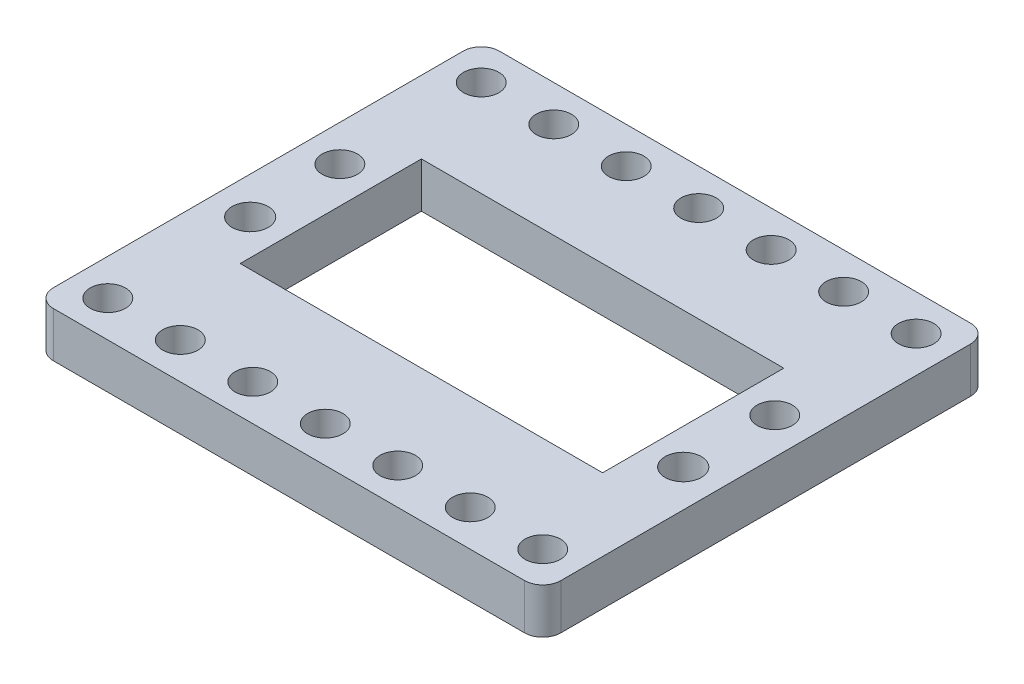
ISO-10303-21;
HEADER;
FILE_DESCRIPTION(('STEP AP214'),'2;1');
FILE_NAME('part.step','',(''),(''),'','','');
FILE_SCHEMA(('AUTOMOTIVE_DESIGN { 1 0 10303 214 1 1 1 1 }'));
ENDSEC;
DATA;
#1=APPLICATION_CONTEXT('core data for automotive mechanical design processes');
#2=APPLICATION_PROTOCOL_DEFINITION('international standard','automotive_design',2000,#1);
#3=PRODUCT_CONTEXT('',#1,'mechanical');
#4=PRODUCT('Part','Part','',(#3));
#5=PRODUCT_RELATED_PRODUCT_CATEGORY('part','',(#4));
#6=PRODUCT_DEFINITION_FORMATION('','',#4);
#7=PRODUCT_DEFINITION_CONTEXT('part definition',#1,'design');
#8=PRODUCT_DEFINITION('design','',#6,#7);
#9=PRODUCT_DEFINITION_SHAPE('','',#8);
#10=(LENGTH_UNIT() NAMED_UNIT(*) SI_UNIT(.MILLI.,.METRE.));
#11=(NAMED_UNIT(*) PLANE_ANGLE_UNIT() SI_UNIT($,.RADIAN.));
#12=(NAMED_UNIT(*) SI_UNIT($,.STERADIAN.) SOLID_ANGLE_UNIT());
#13=UNCERTAINTY_MEASURE_WITH_UNIT(LENGTH_MEASURE(1.E-05),#10,'distance_accuracy_value','');
#14=(GEOMETRIC_REPRESENTATION_CONTEXT(3) GLOBAL_UNCERTAINTY_ASSIGNED_CONTEXT((#13)) GLOBAL_UNIT_ASSIGNED_CONTEXT((#10,
#11,#12)) REPRESENTATION_CONTEXT('',''));
#15=CARTESIAN_POINT('',(0.,0.,0.));
#16=DIRECTION('',(0.,0.,1.));
#17=DIRECTION('',(1.,0.,0.));
#18=AXIS2_PLACEMENT_3D('',#15,#16,#17);
#19=CARTESIAN_POINT('',(76.,5.,2.));
#20=DIRECTION('',(0.,-1.,0.));
#21=DIRECTION('',(0.,0.,-1.));
#22=AXIS2_PLACEMENT_3D('',#19,#20,#21);
#23=CYLINDRICAL_SURFACE('',#22,2.);
#24=DIRECTION('',(0.,-1.,0.));
#25=VECTOR('',#24,1.);
#26=CARTESIAN_POINT('',(76.,5.,0.));
#27=LINE('',#26,#25);
#28=CARTESIAN_POINT('',(76.,5.,0.));
#29=VERTEX_POINT('',#28);
#30=CARTESIAN_POINT('',(76.,0.,0.));
#31=VERTEX_POINT('',#30);
#32=EDGE_CURVE('E304',#29,#31,#27,.T.);
#33=ORIENTED_EDGE('',*,*,#32,.F.);
#34=CARTESIAN_POINT('',(76.,5.,2.));
#35=DIRECTION('',(0.,1.,0.));
#36=DIRECTION('',(0.,0.,1.));
#37=AXIS2_PLACEMENT_3D('',#34,#35,#36);
#38=CIRCLE('',#37,2.);
#39=CARTESIAN_POINT('',(78.,5.,2.));
#40=VERTEX_POINT('',#39);
#41=EDGE_CURVE('E45',#40,#29,#38,.T.);
#42=ORIENTED_EDGE('',*,*,#41,.F.);
#43=DIRECTION('',(0.,-1.,0.));
#44=VECTOR('',#43,1.);
#45=CARTESIAN_POINT('',(78.,-5.,2.));
#46=LINE('',#45,#44);
#47=CARTESIAN_POINT('',(78.,0.,2.));
#48=VERTEX_POINT('',#47);
#49=EDGE_CURVE('E307',#48,#40,#46,.F.);
#50=ORIENTED_EDGE('',*,*,#49,.F.);
#51=CARTESIAN_POINT('',(76.,0.,2.));
#52=DIRECTION('',(0.,1.,0.));
#53=DIRECTION('',(0.,0.,1.));
#54=AXIS2_PLACEMENT_3D('',#51,#52,#53);
#55=CIRCLE('',#54,2.);
#56=EDGE_CURVE('E12',#31,#48,#55,.F.);
#57=ORIENTED_EDGE('',*,*,#56,.F.);
#58=EDGE_LOOP('',(#33,#42,#50,#57));
#59=FACE_BOUND('',#58,.T.);
#60=ADVANCED_FACE('F38',(#59),#23,.T.);
#61=CARTESIAN_POINT('',(76.,-5.,47.22));
#62=DIRECTION('',(0.,-1.,0.));
#63=DIRECTION('',(0.,0.,-1.));
#64=AXIS2_PLACEMENT_3D('',#61,#62,#63);
#65=CYLINDRICAL_SURFACE('',#64,2.);
#66=DIRECTION('',(0.,-1.,0.));
#67=VECTOR('',#66,1.);
#68=CARTESIAN_POINT('',(78.,-5.,47.22));
#69=LINE('',#68,#67);
#70=CARTESIAN_POINT('',(78.,5.,47.22));
#71=VERTEX_POINT('',#70);
#72=CARTESIAN_POINT('',(78.,0.,47.22));
#73=VERTEX_POINT('',#72);
#74=EDGE_CURVE('E292',#71,#73,#69,.T.);
#75=ORIENTED_EDGE('',*,*,#74,.F.);
#76=CARTESIAN_POINT('',(76.,5.,47.22));
#77=DIRECTION('',(0.,1.,0.));
#78=DIRECTION('',(0.,0.,1.));
#79=AXIS2_PLACEMENT_3D('',#76,#77,#78);
#80=CIRCLE('',#79,2.);
#81=CARTESIAN_POINT('',(76.,5.,49.22));
#82=VERTEX_POINT('',#81);
#83=EDGE_CURVE('E296',#82,#71,#80,.T.);
#84=ORIENTED_EDGE('',*,*,#83,.F.);
#85=DIRECTION('',(0.,-1.,0.));
#86=VECTOR('',#85,1.);
#87=CARTESIAN_POINT('',(76.,5.,49.22));
#88=LINE('',#87,#86);
#89=CARTESIAN_POINT('',(76.,0.,49.22));
#90=VERTEX_POINT('',#89);
#91=EDGE_CURVE('E302',#90,#82,#88,.F.);
#92=ORIENTED_EDGE('',*,*,#91,.F.);
#93=CARTESIAN_POINT('',(76.,0.,47.22));
#94=DIRECTION('',(0.,1.,0.));
#95=DIRECTION('',(0.,0.,1.));
#96=AXIS2_PLACEMENT_3D('',#93,#94,#95);
#97=CIRCLE('',#96,2.);
#98=EDGE_CURVE('E301',#73,#90,#97,.F.);
#99=ORIENTED_EDGE('',*,*,#98,.F.);
#100=EDGE_LOOP('',(#75,#84,#92,#99));
#101=FACE_BOUND('',#100,.T.);
#102=ADVANCED_FACE('F401',(#101),#65,.T.);
#103=CARTESIAN_POINT('',(24.,-5.,47.22));
#104=DIRECTION('',(0.,1.,0.));
#105=DIRECTION('',(0.,0.,1.));
#106=AXIS2_PLACEMENT_3D('',#103,#104,#105);
#107=CYLINDRICAL_SURFACE('',#106,2.);
#108=DIRECTION('',(0.,1.,0.));
#109=VECTOR('',#108,1.);
#110=CARTESIAN_POINT('',(22.,-5.,47.22));
#111=LINE('',#110,#109);
#112=CARTESIAN_POINT('',(22.,0.,47.22));
#113=VERTEX_POINT('',#112);
#114=CARTESIAN_POINT('',(22.,5.,47.22));
#115=VERTEX_POINT('',#114);
#116=EDGE_CURVE('E280',#113,#115,#111,.T.);
#117=ORIENTED_EDGE('',*,*,#116,.F.);
#118=CARTESIAN_POINT('',(24.,0.,47.22));
#119=DIRECTION('',(0.,1.,0.));
#120=DIRECTION('',(0.,0.,1.));
#121=AXIS2_PLACEMENT_3D('',#118,#119,#120);
#122=CIRCLE('',#121,2.);
#123=CARTESIAN_POINT('',(24.,0.,49.22));
#124=VERTEX_POINT('',#123);
#125=EDGE_CURVE('E286',#124,#113,#122,.F.);
#126=ORIENTED_EDGE('',*,*,#125,.F.);
#127=DIRECTION('',(0.,1.,0.));
#128=VECTOR('',#127,1.);
#129=CARTESIAN_POINT('',(24.,5.,49.22));
#130=LINE('',#129,#128);
#131=CARTESIAN_POINT('',(24.,5.,49.22));
#132=VERTEX_POINT('',#131);
#133=EDGE_CURVE('E283',#132,#124,#130,.F.);
#134=ORIENTED_EDGE('',*,*,#133,.F.);
#135=CARTESIAN_POINT('',(24.,5.,47.22));
#136=DIRECTION('',(0.,1.,0.));
#137=DIRECTION('',(0.,0.,1.));
#138=AXIS2_PLACEMENT_3D('',#135,#136,#137);
#139=CIRCLE('',#138,2.);
#140=EDGE_CURVE('E288',#115,#132,#139,.T.);
#141=ORIENTED_EDGE('',*,*,#140,.F.);
#142=EDGE_LOOP('',(#117,#126,#134,#141));
#143=FACE_BOUND('',#142,.T.);
#144=ADVANCED_FACE('F405',(#143),#107,.T.);
#145=CARTESIAN_POINT('',(24.,-5.,2.));
#146=DIRECTION('',(0.,-1.,0.));
#147=DIRECTION('',(0.,0.,-1.));
#148=AXIS2_PLACEMENT_3D('',#145,#146,#147);
#149=CYLINDRICAL_SURFACE('',#148,2.);
#150=DIRECTION('',(0.,-1.,0.));
#151=VECTOR('',#150,1.);
#152=CARTESIAN_POINT('',(22.,-5.,2.));
#153=LINE('',#152,#151);
#154=CARTESIAN_POINT('',(22.,5.,2.));
#155=VERTEX_POINT('',#154);
#156=CARTESIAN_POINT('',(22.,0.,2.));
#157=VERTEX_POINT('',#156);
#158=EDGE_CURVE('E324',#155,#157,#153,.T.);
#159=ORIENTED_EDGE('',*,*,#158,.F.);
#160=CARTESIAN_POINT('',(24.,5.,2.));
#161=DIRECTION('',(0.,1.,0.));
#162=DIRECTION('',(0.,0.,1.));
#163=AXIS2_PLACEMENT_3D('',#160,#161,#162);
#164=CIRCLE('',#163,2.);
#165=CARTESIAN_POINT('',(24.,5.,0.));
#166=VERTEX_POINT('',#165);
#167=EDGE_CURVE('E269',#166,#155,#164,.T.);
#168=ORIENTED_EDGE('',*,*,#167,.F.);
#169=DIRECTION('',(0.,-1.,0.));
#170=VECTOR('',#169,1.);
#171=CARTESIAN_POINT('',(24.,5.,0.));
#172=LINE('',#171,#170);
#173=CARTESIAN_POINT('',(24.,0.,0.));
#174=VERTEX_POINT('',#173);
#175=EDGE_CURVE('E276',#174,#166,#172,.F.);
#176=ORIENTED_EDGE('',*,*,#175,.F.);
#177=CARTESIAN_POINT('',(24.,0.,2.));
#178=DIRECTION('',(0.,1.,0.));
#179=DIRECTION('',(0.,0.,1.));
#180=AXIS2_PLACEMENT_3D('',#177,#178,#179);
#181=CIRCLE('',#180,2.);
#182=EDGE_CURVE('E275',#157,#174,#181,.F.);
#183=ORIENTED_EDGE('',*,*,#182,.F.);
#184=EDGE_LOOP('',(#159,#168,#176,#183));
#185=FACE_BOUND('',#184,.T.);
#186=ADVANCED_FACE('F410',(#185),#149,.T.);
#187=CARTESIAN_POINT('',(2.00000000000001,5.,0.));
#188=DIRECTION('',(0.,0.,1.));
#189=DIRECTION('',(1.,0.,0.));
#190=AXIS2_PLACEMENT_3D('',#187,#188,#189);
#191=PLANE('',#190);
#192=DIRECTION('',(-1.,0.,0.));
#193=VECTOR('',#192,1.);
#194=CARTESIAN_POINT('',(2.00000000000001,5.,0.));
#195=LINE('',#194,#193);
#196=EDGE_CURVE('E253',#29,#166,#195,.T.);
#197=ORIENTED_EDGE('',*,*,#196,.F.);
#198=ORIENTED_EDGE('',*,*,#32,.T.);
#199=DIRECTION('',(-1.,0.,0.));
#200=VECTOR('',#199,1.);
#201=CARTESIAN_POINT('',(2.00000000000001,0.,0.));
#202=LINE('',#201,#200);
#203=EDGE_CURVE('E321',#31,#174,#202,.T.);
#204=ORIENTED_EDGE('',*,*,#203,.T.);
#205=ORIENTED_EDGE('',*,*,#175,.T.);
#206=EDGE_LOOP('',(#197,#198,#204,#205));
#207=FACE_BOUND('',#206,.T.);
#208=ADVANCED_FACE('F319',(#207),#191,.F.);
#209=CARTESIAN_POINT('',(2.00000000000001,5.,49.22));
#210=DIRECTION('',(0.,0.,-1.));
#211=DIRECTION('',(-1.,0.,0.));
#212=AXIS2_PLACEMENT_3D('',#209,#210,#211);
#213=PLANE('',#212);
#214=DIRECTION('',(1.,0.,0.));
#215=VECTOR('',#214,1.);
#216=CARTESIAN_POINT('',(2.00000000000001,0.,49.22));
#217=LINE('',#216,#215);
#218=EDGE_CURVE('E258',#124,#90,#217,.T.);
#219=ORIENTED_EDGE('',*,*,#218,.T.);
#220=ORIENTED_EDGE('',*,*,#91,.T.);
#221=DIRECTION('',(1.,0.,0.));
#222=VECTOR('',#221,1.);
#223=CARTESIAN_POINT('',(2.00000000000001,5.,49.22));
#224=LINE('',#223,#222);
#225=EDGE_CURVE('E257',#132,#82,#224,.T.);
#226=ORIENTED_EDGE('',*,*,#225,.F.);
#227=ORIENTED_EDGE('',*,*,#133,.T.);
#228=EDGE_LOOP('',(#219,#220,#226,#227));
#229=FACE_BOUND('',#228,.T.);
#230=ADVANCED_FACE('F419',(#229),#213,.F.);
#231=CARTESIAN_POINT('',(98.,5.,47.22));
#232=DIRECTION('',(0.,1.,0.));
#233=DIRECTION('',(0.,0.,1.));
#234=AXIS2_PLACEMENT_3D('',#231,#232,#233);
#235=PLANE('',#234);
#236=CARTESIAN_POINT('',(73.9,5.,29.6097499937497));
#237=DIRECTION('',(0.,1.,0.));
#238=DIRECTION('',(0.,0.,1.));
#239=AXIS2_PLACEMENT_3D('',#236,#237,#238);
#240=CIRCLE('',#239,2.);
#241=CARTESIAN_POINT('',(73.9,5.,31.6097499937497));
#242=VERTEX_POINT('',#241);
#243=EDGE_CURVE('E772',#242,#242,#240,.T.);
#244=ORIENTED_EDGE('',*,*,#243,.F.);
#245=EDGE_LOOP('',(#244));
#246=FACE_BOUND('',#245,.T.);
#247=CARTESIAN_POINT('',(26.,5.,19.6102500062503));
#248=DIRECTION('',(0.,1.,0.));
#249=DIRECTION('',(0.,0.,1.));
#250=AXIS2_PLACEMENT_3D('',#247,#248,#249);
#251=CIRCLE('',#250,1.95);
#252=CARTESIAN_POINT('',(26.,5.,21.5602500062503));
#253=VERTEX_POINT('',#252);
#254=EDGE_CURVE('E779',#253,#253,#251,.T.);
#255=ORIENTED_EDGE('',*,*,#254,.F.);
#256=EDGE_LOOP('',(#255));
#257=FACE_BOUND('',#256,.T.);
#258=CARTESIAN_POINT('',(26.1,5.,29.6097499937497));
#259=DIRECTION('',(0.,1.,0.));
#260=DIRECTION('',(0.,0.,1.));
#261=AXIS2_PLACEMENT_3D('',#258,#259,#260);
#262=CIRCLE('',#261,2.00000000000001);
#263=CARTESIAN_POINT('',(26.1,5.,31.6097499937497));
#264=VERTEX_POINT('',#263);
#265=EDGE_CURVE('E762',#264,#264,#262,.T.);
#266=ORIENTED_EDGE('',*,*,#265,.F.);
#267=EDGE_LOOP('',(#266));
#268=FACE_BOUND('',#267,.T.);
#269=CARTESIAN_POINT('',(74.,5.,19.6102500062503));
#270=DIRECTION('',(0.,1.,0.));
#271=DIRECTION('',(0.,0.,1.));
#272=AXIS2_PLACEMENT_3D('',#269,#270,#271);
#273=CIRCLE('',#272,1.95);
#274=CARTESIAN_POINT('',(74.,5.,21.5602500062503));
#275=VERTEX_POINT('',#274);
#276=EDGE_CURVE('E753',#275,#275,#273,.T.);
#277=ORIENTED_EDGE('',*,*,#276,.F.);
#278=EDGE_LOOP('',(#277));
#279=FACE_BOUND('',#278,.T.);
#280=DIRECTION('',(0.,0.,1.));
#281=VECTOR('',#280,1.);
#282=CARTESIAN_POINT('',(78.,5.,0.));
#283=LINE('',#282,#281);
#284=EDGE_CURVE('E165',#40,#71,#283,.T.);
#285=ORIENTED_EDGE('',*,*,#284,.F.);
#286=ORIENTED_EDGE('',*,*,#41,.T.);
#287=ORIENTED_EDGE('',*,*,#196,.T.);
#288=ORIENTED_EDGE('',*,*,#167,.T.);
#289=DIRECTION('',(0.,0.,-1.));
#290=VECTOR('',#289,1.);
#291=CARTESIAN_POINT('',(22.,5.,0.));
#292=LINE('',#291,#290);
#293=EDGE_CURVE('E746',#115,#155,#292,.T.);
#294=ORIENTED_EDGE('',*,*,#293,.F.);
#295=ORIENTED_EDGE('',*,*,#140,.T.);
#296=ORIENTED_EDGE('',*,*,#225,.T.);
#297=ORIENTED_EDGE('',*,*,#83,.T.);
#298=EDGE_LOOP('',(#285,#286,#287,#288,#294,#295,#296,#297));
#299=FACE_BOUND('',#298,.T.);
#300=CARTESIAN_POINT('',(74.,5.,4.00475022032541));
#301=DIRECTION('',(0.,1.,0.));
#302=DIRECTION('',(0.,0.,1.));
#303=AXIS2_PLACEMENT_3D('',#300,#301,#302);
#304=CIRCLE('',#303,1.95);
#305=CARTESIAN_POINT('',(74.,5.,5.95475022032541));
#306=VERTEX_POINT('',#305);
#307=EDGE_CURVE('E204',#306,#306,#304,.T.);
#308=ORIENTED_EDGE('',*,*,#307,.F.);
#309=EDGE_LOOP('',(#308));
#310=FACE_BOUND('',#309,.T.);
#311=CARTESIAN_POINT('',(26.,5.,45.22));
#312=DIRECTION('',(0.,1.,0.));
#313=DIRECTION('',(0.,0.,1.));
#314=AXIS2_PLACEMENT_3D('',#311,#312,#313);
#315=CIRCLE('',#314,1.95);
#316=CARTESIAN_POINT('',(26.,5.,47.17));
#317=VERTEX_POINT('',#316);
#318=EDGE_CURVE('E205',#317,#317,#315,.T.);
#319=ORIENTED_EDGE('',*,*,#318,.F.);
#320=EDGE_LOOP('',(#319));
#321=FACE_BOUND('',#320,.T.);
#322=CARTESIAN_POINT('',(34.,5.,45.22));
#323=DIRECTION('',(0.,1.,0.));
#324=DIRECTION('',(0.,0.,1.));
#325=AXIS2_PLACEMENT_3D('',#322,#323,#324);
#326=CIRCLE('',#325,1.94999999999999);
#327=CARTESIAN_POINT('',(34.,5.,47.17));
#328=VERTEX_POINT('',#327);
#329=EDGE_CURVE('E220',#328,#328,#326,.T.);
#330=ORIENTED_EDGE('',*,*,#329,.F.);
#331=EDGE_LOOP('',(#330));
#332=FACE_BOUND('',#331,.T.);
#333=CARTESIAN_POINT('',(42.,5.,45.22));
#334=DIRECTION('',(0.,1.,0.));
#335=DIRECTION('',(0.,0.,1.));
#336=AXIS2_PLACEMENT_3D('',#333,#334,#335);
#337=CIRCLE('',#336,1.95000000000001);
#338=CARTESIAN_POINT('',(42.,5.,47.17));
#339=VERTEX_POINT('',#338);
#340=EDGE_CURVE('E227',#339,#339,#337,.T.);
#341=ORIENTED_EDGE('',*,*,#340,.F.);
#342=EDGE_LOOP('',(#341));
#343=FACE_BOUND('',#342,.T.);
#344=CARTESIAN_POINT('',(50.,5.,45.22));
#345=DIRECTION('',(0.,1.,0.));
#346=DIRECTION('',(0.,0.,1.));
#347=AXIS2_PLACEMENT_3D('',#344,#345,#346);
#348=CIRCLE('',#347,1.95);
#349=CARTESIAN_POINT('',(50.,5.,47.17));
#350=VERTEX_POINT('',#349);
#351=EDGE_CURVE('E185',#350,#350,#348,.T.);
#352=ORIENTED_EDGE('',*,*,#351,.F.);
#353=EDGE_LOOP('',(#352));
#354=FACE_BOUND('',#353,.T.);
#355=CARTESIAN_POINT('',(34.,5.,4.00475022032542));
#356=DIRECTION('',(0.,1.,0.));
#357=DIRECTION('',(0.,0.,1.));
#358=AXIS2_PLACEMENT_3D('',#355,#356,#357);
#359=CIRCLE('',#358,1.95);
#360=CARTESIAN_POINT('',(34.,5.,5.95475022032542));
#361=VERTEX_POINT('',#360);
#362=EDGE_CURVE('E245',#361,#361,#359,.T.);
#363=ORIENTED_EDGE('',*,*,#362,.F.);
#364=EDGE_LOOP('',(#363));
#365=FACE_BOUND('',#364,.T.);
#366=CARTESIAN_POINT('',(26.,5.,4.00475022032542));
#367=DIRECTION('',(0.,1.,0.));
#368=DIRECTION('',(0.,0.,1.));
#369=AXIS2_PLACEMENT_3D('',#366,#367,#368);
#370=CIRCLE('',#369,1.95);
#371=CARTESIAN_POINT('',(26.,5.,5.95475022032542));
#372=VERTEX_POINT('',#371);
#373=EDGE_CURVE('E337',#372,#372,#370,.T.);
#374=ORIENTED_EDGE('',*,*,#373,.F.);
#375=EDGE_LOOP('',(#374));
#376=FACE_BOUND('',#375,.T.);
#377=CARTESIAN_POINT('',(42.,5.,4.00475022032542));
#378=DIRECTION('',(0.,1.,0.));
#379=DIRECTION('',(0.,0.,1.));
#380=AXIS2_PLACEMENT_3D('',#377,#378,#379);
#381=CIRCLE('',#380,1.95000000000001);
#382=CARTESIAN_POINT('',(42.,5.,5.95475022032542));
#383=VERTEX_POINT('',#382);
#384=EDGE_CURVE('E368',#383,#383,#381,.T.);
#385=ORIENTED_EDGE('',*,*,#384,.F.);
#386=EDGE_LOOP('',(#385));
#387=FACE_BOUND('',#386,.T.);
#388=CARTESIAN_POINT('',(50.,5.,4.00475022032542));
#389=DIRECTION('',(0.,1.,0.));
#390=DIRECTION('',(0.,0.,1.));
#391=AXIS2_PLACEMENT_3D('',#388,#389,#390);
#392=CIRCLE('',#391,1.95);
#393=CARTESIAN_POINT('',(50.,5.,5.95475022032542));
#394=VERTEX_POINT('',#393);
#395=EDGE_CURVE('E361',#394,#394,#392,.T.);
#396=ORIENTED_EDGE('',*,*,#395,.F.);
#397=EDGE_LOOP('',(#396));
#398=FACE_BOUND('',#397,.T.);
#399=CARTESIAN_POINT('',(58.,5.,4.00475022032542));
#400=DIRECTION('',(0.,1.,0.));
#401=DIRECTION('',(0.,0.,1.));
#402=AXIS2_PLACEMENT_3D('',#399,#400,#401);
#403=CIRCLE('',#402,1.95);
#404=CARTESIAN_POINT('',(58.,5.,5.95475022032541));
#405=VERTEX_POINT('',#404);
#406=EDGE_CURVE('E352',#405,#405,#403,.T.);
#407=ORIENTED_EDGE('',*,*,#406,.F.);
#408=EDGE_LOOP('',(#407));
#409=FACE_BOUND('',#408,.T.);
#410=CARTESIAN_POINT('',(66.,5.,4.00475022032541));
#411=DIRECTION('',(0.,1.,0.));
#412=DIRECTION('',(0.,0.,1.));
#413=AXIS2_PLACEMENT_3D('',#410,#411,#412);
#414=CIRCLE('',#413,1.95);
#415=CARTESIAN_POINT('',(66.,5.,5.95475022032541));
#416=VERTEX_POINT('',#415);
#417=EDGE_CURVE('E343',#416,#416,#414,.T.);
#418=ORIENTED_EDGE('',*,*,#417,.F.);
#419=EDGE_LOOP('',(#418));
#420=FACE_BOUND('',#419,.T.);
#421=DIRECTION('',(0.,0.,1.));
#422=VECTOR('',#421,1.);
#423=CARTESIAN_POINT('',(30.,5.,14.61));
#424=LINE('',#423,#422);
#425=CARTESIAN_POINT('',(30.,5.,14.61));
#426=VERTEX_POINT('',#425);
#427=CARTESIAN_POINT('',(30.,5.,34.61));
#428=VERTEX_POINT('',#427);
#429=EDGE_CURVE('E130',#426,#428,#424,.T.);
#430=ORIENTED_EDGE('',*,*,#429,.F.);
#431=DIRECTION('',(-1.,0.,0.));
#432=VECTOR('',#431,1.);
#433=CARTESIAN_POINT('',(30.,5.,14.61));
#434=LINE('',#433,#432);
#435=CARTESIAN_POINT('',(70.,5.,14.61));
#436=VERTEX_POINT('',#435);
#437=EDGE_CURVE('E148',#436,#426,#434,.T.);
#438=ORIENTED_EDGE('',*,*,#437,.F.);
#439=DIRECTION('',(0.,0.,-1.));
#440=VECTOR('',#439,1.);
#441=CARTESIAN_POINT('',(70.,5.,14.61));
#442=LINE('',#441,#440);
#443=CARTESIAN_POINT('',(70.,5.,34.61));
#444=VERTEX_POINT('',#443);
#445=EDGE_CURVE('E152',#444,#436,#442,.T.);
#446=ORIENTED_EDGE('',*,*,#445,.F.);
#447=DIRECTION('',(1.,0.,0.));
#448=VECTOR('',#447,1.);
#449=CARTESIAN_POINT('',(30.,5.,34.61));
#450=LINE('',#449,#448);
#451=EDGE_CURVE('E164',#428,#444,#450,.T.);
#452=ORIENTED_EDGE('',*,*,#451,.F.);
#453=EDGE_LOOP('',(#430,#438,#446,#452));
#454=FACE_BOUND('',#453,.T.);
#455=CARTESIAN_POINT('',(74.,5.,45.22));
#456=DIRECTION('',(0.,1.,0.));
#457=DIRECTION('',(0.,0.,1.));
#458=AXIS2_PLACEMENT_3D('',#455,#456,#457);
#459=CIRCLE('',#458,1.95);
#460=CARTESIAN_POINT('',(74.,5.,47.17));
#461=VERTEX_POINT('',#460);
#462=EDGE_CURVE('E155',#461,#461,#459,.T.);
#463=ORIENTED_EDGE('',*,*,#462,.F.);
#464=EDGE_LOOP('',(#463));
#465=FACE_BOUND('',#464,.T.);
#466=CARTESIAN_POINT('',(66.,5.,45.22));
#467=DIRECTION('',(0.,1.,0.));
#468=DIRECTION('',(0.,0.,1.));
#469=AXIS2_PLACEMENT_3D('',#466,#467,#468);
#470=CIRCLE('',#469,1.95);
#471=CARTESIAN_POINT('',(66.,5.,47.17));
#472=VERTEX_POINT('',#471);
#473=EDGE_CURVE('E194',#472,#472,#470,.T.);
#474=ORIENTED_EDGE('',*,*,#473,.F.);
#475=EDGE_LOOP('',(#474));
#476=FACE_BOUND('',#475,.T.);
#477=CARTESIAN_POINT('',(58.,5.,45.22));
#478=DIRECTION('',(0.,1.,0.));
#479=DIRECTION('',(0.,0.,1.));
#480=AXIS2_PLACEMENT_3D('',#477,#478,#479);
#481=CIRCLE('',#480,1.95);
#482=CARTESIAN_POINT('',(58.,5.,47.17));
#483=VERTEX_POINT('',#482);
#484=EDGE_CURVE('E186',#483,#483,#481,.T.);
#485=ORIENTED_EDGE('',*,*,#484,.F.);
#486=EDGE_LOOP('',(#485));
#487=FACE_BOUND('',#486,.T.);
#488=ADVANCED_FACE('F313',(#246,#257,#268,#279,#299,#310,#321,#332,#343,#354,#365,#376,#387,
#398,#409,#420,#454,#465,#476,#487),#235,.T.);
#489=CARTESIAN_POINT('',(98.,0.,47.22));
#490=DIRECTION('',(0.,1.,0.));
#491=DIRECTION('',(0.,0.,1.));
#492=AXIS2_PLACEMENT_3D('',#489,#490,#491);
#493=PLANE('',#492);
#494=CARTESIAN_POINT('',(73.9,0.,29.6097499937497));
#495=DIRECTION('',(0.,1.,0.));
#496=DIRECTION('',(0.,0.,1.));
#497=AXIS2_PLACEMENT_3D('',#494,#495,#496);
#498=CIRCLE('',#497,2.);
#499=CARTESIAN_POINT('',(73.9,0.,31.6097499937497));
#500=VERTEX_POINT('',#499);
#501=EDGE_CURVE('E769',#500,#500,#498,.T.);
#502=ORIENTED_EDGE('',*,*,#501,.T.);
#503=EDGE_LOOP('',(#502));
#504=FACE_BOUND('',#503,.T.);
#505=CARTESIAN_POINT('',(26.,0.,19.6102500062503));
#506=DIRECTION('',(0.,1.,0.));
#507=DIRECTION('',(0.,0.,1.));
#508=AXIS2_PLACEMENT_3D('',#505,#506,#507);
#509=CIRCLE('',#508,1.95);
#510=CARTESIAN_POINT('',(26.,0.,21.5602500062503));
#511=VERTEX_POINT('',#510);
#512=EDGE_CURVE('E777',#511,#511,#509,.T.);
#513=ORIENTED_EDGE('',*,*,#512,.T.);
#514=EDGE_LOOP('',(#513));
#515=FACE_BOUND('',#514,.T.);
#516=CARTESIAN_POINT('',(26.1,0.,29.6097499937497));
#517=DIRECTION('',(0.,1.,0.));
#518=DIRECTION('',(0.,0.,1.));
#519=AXIS2_PLACEMENT_3D('',#516,#517,#518);
#520=CIRCLE('',#519,2.00000000000001);
#521=CARTESIAN_POINT('',(26.1,0.,31.6097499937497));
#522=VERTEX_POINT('',#521);
#523=EDGE_CURVE('E768',#522,#522,#520,.T.);
#524=ORIENTED_EDGE('',*,*,#523,.T.);
#525=EDGE_LOOP('',(#524));
#526=FACE_BOUND('',#525,.T.);
#527=CARTESIAN_POINT('',(74.,0.,19.6102500062503));
#528=DIRECTION('',(0.,1.,0.));
#529=DIRECTION('',(0.,0.,1.));
#530=AXIS2_PLACEMENT_3D('',#527,#528,#529);
#531=CIRCLE('',#530,1.95);
#532=CARTESIAN_POINT('',(74.,0.,21.5602500062503));
#533=VERTEX_POINT('',#532);
#534=EDGE_CURVE('E750',#533,#533,#531,.T.);
#535=ORIENTED_EDGE('',*,*,#534,.T.);
#536=EDGE_LOOP('',(#535));
#537=FACE_BOUND('',#536,.T.);
#538=CARTESIAN_POINT('',(74.,0.,4.00475022032541));
#539=DIRECTION('',(0.,1.,0.));
#540=DIRECTION('',(0.,0.,1.));
#541=AXIS2_PLACEMENT_3D('',#538,#539,#540);
#542=CIRCLE('',#541,1.95);
#543=CARTESIAN_POINT('',(74.,0.,5.95475022032541));
#544=VERTEX_POINT('',#543);
#545=EDGE_CURVE('E239',#544,#544,#542,.T.);
#546=ORIENTED_EDGE('',*,*,#545,.T.);
#547=EDGE_LOOP('',(#546));
#548=FACE_BOUND('',#547,.T.);
#549=CARTESIAN_POINT('',(26.,0.,45.22));
#550=DIRECTION('',(0.,1.,0.));
#551=DIRECTION('',(0.,0.,1.));
#552=AXIS2_PLACEMENT_3D('',#549,#550,#551);
#553=CIRCLE('',#552,1.95);
#554=CARTESIAN_POINT('',(26.,0.,47.17));
#555=VERTEX_POINT('',#554);
#556=EDGE_CURVE('E200',#555,#555,#553,.T.);
#557=ORIENTED_EDGE('',*,*,#556,.T.);
#558=EDGE_LOOP('',(#557));
#559=FACE_BOUND('',#558,.T.);
#560=CARTESIAN_POINT('',(34.,0.,45.22));
#561=DIRECTION('',(0.,1.,0.));
#562=DIRECTION('',(0.,0.,1.));
#563=AXIS2_PLACEMENT_3D('',#560,#561,#562);
#564=CIRCLE('',#563,1.94999999999999);
#565=CARTESIAN_POINT('',(34.,0.,47.17));
#566=VERTEX_POINT('',#565);
#567=EDGE_CURVE('E210',#566,#566,#564,.T.);
#568=ORIENTED_EDGE('',*,*,#567,.T.);
#569=EDGE_LOOP('',(#568));
#570=FACE_BOUND('',#569,.T.);
#571=CARTESIAN_POINT('',(42.,0.,45.22));
#572=DIRECTION('',(0.,1.,0.));
#573=DIRECTION('',(0.,0.,1.));
#574=AXIS2_PLACEMENT_3D('',#571,#572,#573);
#575=CIRCLE('',#574,1.95000000000001);
#576=CARTESIAN_POINT('',(42.,0.,47.17));
#577=VERTEX_POINT('',#576);
#578=EDGE_CURVE('E225',#577,#577,#575,.T.);
#579=ORIENTED_EDGE('',*,*,#578,.T.);
#580=EDGE_LOOP('',(#579));
#581=FACE_BOUND('',#580,.T.);
#582=CARTESIAN_POINT('',(50.,0.,45.22));
#583=DIRECTION('',(0.,1.,0.));
#584=DIRECTION('',(0.,0.,1.));
#585=AXIS2_PLACEMENT_3D('',#582,#583,#584);
#586=CIRCLE('',#585,1.95);
#587=CARTESIAN_POINT('',(50.,0.,47.17));
#588=VERTEX_POINT('',#587);
#589=EDGE_CURVE('E232',#588,#588,#586,.T.);
#590=ORIENTED_EDGE('',*,*,#589,.T.);
#591=EDGE_LOOP('',(#590));
#592=FACE_BOUND('',#591,.T.);
#593=CARTESIAN_POINT('',(34.,0.,4.00475022032542));
#594=DIRECTION('',(0.,1.,0.));
#595=DIRECTION('',(0.,0.,1.));
#596=AXIS2_PLACEMENT_3D('',#593,#594,#595);
#597=CIRCLE('',#596,1.95);
#598=CARTESIAN_POINT('',(34.,0.,5.95475022032542));
#599=VERTEX_POINT('',#598);
#600=EDGE_CURVE('E251',#599,#599,#597,.T.);
#601=ORIENTED_EDGE('',*,*,#600,.T.);
#602=EDGE_LOOP('',(#601));
#603=FACE_BOUND('',#602,.T.);
#604=CARTESIAN_POINT('',(26.,0.,4.00475022032542));
#605=DIRECTION('',(0.,1.,0.));
#606=DIRECTION('',(0.,0.,1.));
#607=AXIS2_PLACEMENT_3D('',#604,#605,#606);
#608=CIRCLE('',#607,1.95);
#609=CARTESIAN_POINT('',(26.,0.,5.95475022032542));
#610=VERTEX_POINT('',#609);
#611=EDGE_CURVE('E335',#610,#610,#608,.T.);
#612=ORIENTED_EDGE('',*,*,#611,.T.);
#613=EDGE_LOOP('',(#612));
#614=FACE_BOUND('',#613,.T.);
#615=CARTESIAN_POINT('',(42.,0.,4.00475022032542));
#616=DIRECTION('',(0.,1.,0.));
#617=DIRECTION('',(0.,0.,1.));
#618=AXIS2_PLACEMENT_3D('',#615,#616,#617);
#619=CIRCLE('',#618,1.95000000000001);
#620=CARTESIAN_POINT('',(42.,0.,5.95475022032542));
#621=VERTEX_POINT('',#620);
#622=EDGE_CURVE('E252',#621,#621,#619,.T.);
#623=ORIENTED_EDGE('',*,*,#622,.T.);
#624=EDGE_LOOP('',(#623));
#625=FACE_BOUND('',#624,.T.);
#626=CARTESIAN_POINT('',(50.,0.,4.00475022032542));
#627=DIRECTION('',(0.,1.,0.));
#628=DIRECTION('',(0.,0.,1.));
#629=AXIS2_PLACEMENT_3D('',#626,#627,#628);
#630=CIRCLE('',#629,1.95);
#631=CARTESIAN_POINT('',(50.,0.,5.95475022032542));
#632=VERTEX_POINT('',#631);
#633=EDGE_CURVE('E366',#632,#632,#630,.T.);
#634=ORIENTED_EDGE('',*,*,#633,.T.);
#635=EDGE_LOOP('',(#634));
#636=FACE_BOUND('',#635,.T.);
#637=CARTESIAN_POINT('',(58.,0.,4.00475022032542));
#638=DIRECTION('',(0.,1.,0.));
#639=DIRECTION('',(0.,0.,1.));
#640=AXIS2_PLACEMENT_3D('',#637,#638,#639);
#641=CIRCLE('',#640,1.95);
#642=CARTESIAN_POINT('',(58.,0.,5.95475022032541));
#643=VERTEX_POINT('',#642);
#644=EDGE_CURVE('E357',#643,#643,#641,.T.);
#645=ORIENTED_EDGE('',*,*,#644,.T.);
#646=EDGE_LOOP('',(#645));
#647=FACE_BOUND('',#646,.T.);
#648=CARTESIAN_POINT('',(66.,0.,4.00475022032541));
#649=DIRECTION('',(0.,1.,0.));
#650=DIRECTION('',(0.,0.,1.));
#651=AXIS2_PLACEMENT_3D('',#648,#649,#650);
#652=CIRCLE('',#651,1.95);
#653=CARTESIAN_POINT('',(66.,0.,5.95475022032541));
#654=VERTEX_POINT('',#653);
#655=EDGE_CURVE('E349',#654,#654,#652,.T.);
#656=ORIENTED_EDGE('',*,*,#655,.T.);
#657=EDGE_LOOP('',(#656));
#658=FACE_BOUND('',#657,.T.);
#659=DIRECTION('',(-1.,0.,0.));
#660=VECTOR('',#659,1.);
#661=CARTESIAN_POINT('',(30.,0.,14.61));
#662=LINE('',#661,#660);
#663=CARTESIAN_POINT('',(70.,0.,14.61));
#664=VERTEX_POINT('',#663);
#665=CARTESIAN_POINT('',(30.,0.,14.61));
#666=VERTEX_POINT('',#665);
#667=EDGE_CURVE('E135',#664,#666,#662,.T.);
#668=ORIENTED_EDGE('',*,*,#667,.T.);
#669=DIRECTION('',(0.,0.,1.));
#670=VECTOR('',#669,1.);
#671=CARTESIAN_POINT('',(30.,0.,14.61));
#672=LINE('',#671,#670);
#673=CARTESIAN_POINT('',(30.,0.,34.61));
#674=VERTEX_POINT('',#673);
#675=EDGE_CURVE('E127',#666,#674,#672,.T.);
#676=ORIENTED_EDGE('',*,*,#675,.T.);
#677=DIRECTION('',(1.,0.,0.));
#678=VECTOR('',#677,1.);
#679=CARTESIAN_POINT('',(30.,0.,34.61));
#680=LINE('',#679,#678);
#681=CARTESIAN_POINT('',(70.,0.,34.61));
#682=VERTEX_POINT('',#681);
#683=EDGE_CURVE('E139',#674,#682,#680,.T.);
#684=ORIENTED_EDGE('',*,*,#683,.T.);
#685=DIRECTION('',(0.,0.,-1.));
#686=VECTOR('',#685,1.);
#687=CARTESIAN_POINT('',(70.,0.,14.61));
#688=LINE('',#687,#686);
#689=EDGE_CURVE('E143',#682,#664,#688,.T.);
#690=ORIENTED_EDGE('',*,*,#689,.T.);
#691=EDGE_LOOP('',(#668,#676,#684,#690));
#692=FACE_BOUND('',#691,.T.);
#693=CARTESIAN_POINT('',(74.,0.,45.22));
#694=DIRECTION('',(0.,1.,0.));
#695=DIRECTION('',(0.,0.,1.));
#696=AXIS2_PLACEMENT_3D('',#693,#694,#695);
#697=CIRCLE('',#696,1.95);
#698=CARTESIAN_POINT('',(74.,0.,47.17));
#699=VERTEX_POINT('',#698);
#700=EDGE_CURVE('E199',#699,#699,#697,.T.);
#701=ORIENTED_EDGE('',*,*,#700,.T.);
#702=EDGE_LOOP('',(#701));
#703=FACE_BOUND('',#702,.T.);
#704=CARTESIAN_POINT('',(66.,0.,45.22));
#705=DIRECTION('',(0.,1.,0.));
#706=DIRECTION('',(0.,0.,1.));
#707=AXIS2_PLACEMENT_3D('',#704,#705,#706);
#708=CIRCLE('',#707,1.95);
#709=CARTESIAN_POINT('',(66.,0.,47.17));
#710=VERTEX_POINT('',#709);
#711=EDGE_CURVE('E191',#710,#710,#708,.T.);
#712=ORIENTED_EDGE('',*,*,#711,.T.);
#713=EDGE_LOOP('',(#712));
#714=FACE_BOUND('',#713,.T.);
#715=CARTESIAN_POINT('',(58.,0.,45.22));
#716=DIRECTION('',(0.,1.,0.));
#717=DIRECTION('',(0.,0.,1.));
#718=AXIS2_PLACEMENT_3D('',#715,#716,#717);
#719=CIRCLE('',#718,1.95);
#720=CARTESIAN_POINT('',(58.,0.,47.17));
#721=VERTEX_POINT('',#720);
#722=EDGE_CURVE('E183',#721,#721,#719,.T.);
#723=ORIENTED_EDGE('',*,*,#722,.T.);
#724=EDGE_LOOP('',(#723));
#725=FACE_BOUND('',#724,.T.);
#726=ORIENTED_EDGE('',*,*,#203,.F.);
#727=ORIENTED_EDGE('',*,*,#56,.T.);
#728=DIRECTION('',(0.,0.,1.));
#729=VECTOR('',#728,1.);
#730=CARTESIAN_POINT('',(78.,0.,47.22));
#731=LINE('',#730,#729);
#732=EDGE_CURVE('E326',#48,#73,#731,.T.);
#733=ORIENTED_EDGE('',*,*,#732,.T.);
#734=ORIENTED_EDGE('',*,*,#98,.T.);
#735=ORIENTED_EDGE('',*,*,#218,.F.);
#736=ORIENTED_EDGE('',*,*,#125,.T.);
#737=DIRECTION('',(0.,0.,-1.));
#738=VECTOR('',#737,1.);
#739=CARTESIAN_POINT('',(22.,0.,47.22));
#740=LINE('',#739,#738);
#741=EDGE_CURVE('E330',#113,#157,#740,.T.);
#742=ORIENTED_EDGE('',*,*,#741,.T.);
#743=ORIENTED_EDGE('',*,*,#182,.T.);
#744=EDGE_LOOP('',(#726,#727,#733,#734,#735,#736,#742,#743));
#745=FACE_BOUND('',#744,.T.);
#746=ADVANCED_FACE('F145',(#504,#515,#526,#537,#548,#559,#570,#581,#592,#603,#614,#625,#636,
#647,#658,#692,#703,#714,#725,#745),#493,.F.);
#747=CARTESIAN_POINT('',(58.,0.,45.22));
#748=DIRECTION('',(0.,1.,0.));
#749=DIRECTION('',(0.,0.,1.));
#750=AXIS2_PLACEMENT_3D('',#747,#748,#749);
#751=CYLINDRICAL_SURFACE('',#750,1.95);
#752=ORIENTED_EDGE('',*,*,#722,.F.);
#753=EDGE_LOOP('',(#752));
#754=FACE_BOUND('',#753,.T.);
#755=ORIENTED_EDGE('',*,*,#484,.T.);
#756=EDGE_LOOP('',(#755));
#757=FACE_BOUND('',#756,.T.);
#758=ADVANCED_FACE('F425',(#754,#757),#751,.F.);
#759=CARTESIAN_POINT('',(66.,0.,45.22));
#760=DIRECTION('',(0.,1.,0.));
#761=DIRECTION('',(0.,0.,1.));
#762=AXIS2_PLACEMENT_3D('',#759,#760,#761);
#763=CYLINDRICAL_SURFACE('',#762,1.95);
#764=ORIENTED_EDGE('',*,*,#711,.F.);
#765=EDGE_LOOP('',(#764));
#766=FACE_BOUND('',#765,.T.);
#767=ORIENTED_EDGE('',*,*,#473,.T.);
#768=EDGE_LOOP('',(#767));
#769=FACE_BOUND('',#768,.T.);
#770=ADVANCED_FACE('F476',(#766,#769),#763,.F.);
#771=CARTESIAN_POINT('',(74.,0.,45.22));
#772=DIRECTION('',(0.,1.,0.));
#773=DIRECTION('',(0.,0.,1.));
#774=AXIS2_PLACEMENT_3D('',#771,#772,#773);
#775=CYLINDRICAL_SURFACE('',#774,1.95);
#776=ORIENTED_EDGE('',*,*,#700,.F.);
#777=EDGE_LOOP('',(#776));
#778=FACE_BOUND('',#777,.T.);
#779=ORIENTED_EDGE('',*,*,#462,.T.);
#780=EDGE_LOOP('',(#779));
#781=FACE_BOUND('',#780,.T.);
#782=ADVANCED_FACE('F482',(#778,#781),#775,.F.);
#783=CARTESIAN_POINT('',(30.,0.,14.61));
#784=DIRECTION('',(-1.,0.,0.));
#785=DIRECTION('',(0.,0.,1.));
#786=AXIS2_PLACEMENT_3D('',#783,#784,#785);
#787=PLANE('',#786);
#788=ORIENTED_EDGE('',*,*,#429,.T.);
#789=DIRECTION('',(0.,1.,0.));
#790=VECTOR('',#789,1.);
#791=CARTESIAN_POINT('',(30.,0.,34.61));
#792=LINE('',#791,#790);
#793=EDGE_CURVE('E123',#674,#428,#792,.T.);
#794=ORIENTED_EDGE('',*,*,#793,.F.);
#795=ORIENTED_EDGE('',*,*,#675,.F.);
#796=DIRECTION('',(0.,1.,0.));
#797=VECTOR('',#796,1.);
#798=CARTESIAN_POINT('',(30.,0.,14.61));
#799=LINE('',#798,#797);
#800=EDGE_CURVE('E178',#666,#426,#799,.T.);
#801=ORIENTED_EDGE('',*,*,#800,.T.);
#802=EDGE_LOOP('',(#788,#794,#795,#801));
#803=FACE_BOUND('',#802,.T.);
#804=ADVANCED_FACE('F125',(#803),#787,.F.);
#805=CARTESIAN_POINT('',(30.,0.,14.61));
#806=DIRECTION('',(0.,0.,-1.));
#807=DIRECTION('',(-1.,0.,0.));
#808=AXIS2_PLACEMENT_3D('',#805,#806,#807);
#809=PLANE('',#808);
#810=ORIENTED_EDGE('',*,*,#437,.T.);
#811=ORIENTED_EDGE('',*,*,#800,.F.);
#812=ORIENTED_EDGE('',*,*,#667,.F.);
#813=DIRECTION('',(0.,1.,0.));
#814=VECTOR('',#813,1.);
#815=CARTESIAN_POINT('',(70.,0.,14.61));
#816=LINE('',#815,#814);
#817=EDGE_CURVE('E180',#664,#436,#816,.T.);
#818=ORIENTED_EDGE('',*,*,#817,.T.);
#819=EDGE_LOOP('',(#810,#811,#812,#818));
#820=FACE_BOUND('',#819,.T.);
#821=ADVANCED_FACE('F652',(#820),#809,.F.);
#822=CARTESIAN_POINT('',(70.,0.,14.61));
#823=DIRECTION('',(1.,0.,0.));
#824=DIRECTION('',(0.,0.,-1.));
#825=AXIS2_PLACEMENT_3D('',#822,#823,#824);
#826=PLANE('',#825);
#827=ORIENTED_EDGE('',*,*,#445,.T.);
#828=ORIENTED_EDGE('',*,*,#817,.F.);
#829=ORIENTED_EDGE('',*,*,#689,.F.);
#830=DIRECTION('',(0.,1.,0.));
#831=VECTOR('',#830,1.);
#832=CARTESIAN_POINT('',(70.,0.,34.61));
#833=LINE('',#832,#831);
#834=EDGE_CURVE('E134',#682,#444,#833,.T.);
#835=ORIENTED_EDGE('',*,*,#834,.T.);
#836=EDGE_LOOP('',(#827,#828,#829,#835));
#837=FACE_BOUND('',#836,.T.);
#838=ADVANCED_FACE('F655',(#837),#826,.F.);
#839=CARTESIAN_POINT('',(30.,0.,34.61));
#840=DIRECTION('',(0.,0.,1.));
#841=DIRECTION('',(1.,0.,0.));
#842=AXIS2_PLACEMENT_3D('',#839,#840,#841);
#843=PLANE('',#842);
#844=ORIENTED_EDGE('',*,*,#451,.T.);
#845=ORIENTED_EDGE('',*,*,#834,.F.);
#846=ORIENTED_EDGE('',*,*,#683,.F.);
#847=ORIENTED_EDGE('',*,*,#793,.T.);
#848=EDGE_LOOP('',(#844,#845,#846,#847));
#849=FACE_BOUND('',#848,.T.);
#850=ADVANCED_FACE('F140',(#849),#843,.F.);
#851=CARTESIAN_POINT('',(66.,0.,4.00475022032541));
#852=DIRECTION('',(0.,1.,0.));
#853=DIRECTION('',(0.,0.,1.));
#854=AXIS2_PLACEMENT_3D('',#851,#852,#853);
#855=CYLINDRICAL_SURFACE('',#854,1.95);
#856=ORIENTED_EDGE('',*,*,#655,.F.);
#857=EDGE_LOOP('',(#856));
#858=FACE_BOUND('',#857,.T.);
#859=ORIENTED_EDGE('',*,*,#417,.T.);
#860=EDGE_LOOP('',(#859));
#861=FACE_BOUND('',#860,.T.);
#862=ADVANCED_FACE('F440',(#858,#861),#855,.F.);
#863=CARTESIAN_POINT('',(58.,0.,4.00475022032542));
#864=DIRECTION('',(0.,1.,0.));
#865=DIRECTION('',(0.,0.,1.));
#866=AXIS2_PLACEMENT_3D('',#863,#864,#865);
#867=CYLINDRICAL_SURFACE('',#866,1.95);
#868=ORIENTED_EDGE('',*,*,#644,.F.);
#869=EDGE_LOOP('',(#868));
#870=FACE_BOUND('',#869,.T.);
#871=ORIENTED_EDGE('',*,*,#406,.T.);
#872=EDGE_LOOP('',(#871));
#873=FACE_BOUND('',#872,.T.);
#874=ADVANCED_FACE('F443',(#870,#873),#867,.F.);
#875=CARTESIAN_POINT('',(50.,0.,4.00475022032542));
#876=DIRECTION('',(0.,1.,0.));
#877=DIRECTION('',(0.,0.,1.));
#878=AXIS2_PLACEMENT_3D('',#875,#876,#877);
#879=CYLINDRICAL_SURFACE('',#878,1.95);
#880=ORIENTED_EDGE('',*,*,#633,.F.);
#881=EDGE_LOOP('',(#880));
#882=FACE_BOUND('',#881,.T.);
#883=ORIENTED_EDGE('',*,*,#395,.T.);
#884=EDGE_LOOP('',(#883));
#885=FACE_BOUND('',#884,.T.);
#886=ADVANCED_FACE('F447',(#882,#885),#879,.F.);
#887=CARTESIAN_POINT('',(42.,0.,4.00475022032542));
#888=DIRECTION('',(0.,1.,0.));
#889=DIRECTION('',(0.,0.,1.));
#890=AXIS2_PLACEMENT_3D('',#887,#888,#889);
#891=CYLINDRICAL_SURFACE('',#890,1.95000000000001);
#892=ORIENTED_EDGE('',*,*,#622,.F.);
#893=EDGE_LOOP('',(#892));
#894=FACE_BOUND('',#893,.T.);
#895=ORIENTED_EDGE('',*,*,#384,.T.);
#896=EDGE_LOOP('',(#895));
#897=FACE_BOUND('',#896,.T.);
#898=ADVANCED_FACE('F438',(#894,#897),#891,.F.);
#899=CARTESIAN_POINT('',(26.,0.,4.00475022032542));
#900=DIRECTION('',(0.,1.,0.));
#901=DIRECTION('',(0.,0.,1.));
#902=AXIS2_PLACEMENT_3D('',#899,#900,#901);
#903=CYLINDRICAL_SURFACE('',#902,1.95);
#904=ORIENTED_EDGE('',*,*,#611,.F.);
#905=EDGE_LOOP('',(#904));
#906=FACE_BOUND('',#905,.T.);
#907=ORIENTED_EDGE('',*,*,#373,.T.);
#908=EDGE_LOOP('',(#907));
#909=FACE_BOUND('',#908,.T.);
#910=ADVANCED_FACE('F434',(#906,#909),#903,.F.);
#911=CARTESIAN_POINT('',(34.,0.,4.00475022032542));
#912=DIRECTION('',(0.,1.,0.));
#913=DIRECTION('',(0.,0.,1.));
#914=AXIS2_PLACEMENT_3D('',#911,#912,#913);
#915=CYLINDRICAL_SURFACE('',#914,1.95);
#916=ORIENTED_EDGE('',*,*,#600,.F.);
#917=EDGE_LOOP('',(#916));
#918=FACE_BOUND('',#917,.T.);
#919=ORIENTED_EDGE('',*,*,#362,.T.);
#920=EDGE_LOOP('',(#919));
#921=FACE_BOUND('',#920,.T.);
#922=ADVANCED_FACE('F430',(#918,#921),#915,.F.);
#923=CARTESIAN_POINT('',(50.,0.,45.22));
#924=DIRECTION('',(0.,1.,0.));
#925=DIRECTION('',(0.,0.,1.));
#926=AXIS2_PLACEMENT_3D('',#923,#924,#925);
#927=CYLINDRICAL_SURFACE('',#926,1.95);
#928=ORIENTED_EDGE('',*,*,#589,.F.);
#929=EDGE_LOOP('',(#928));
#930=FACE_BOUND('',#929,.T.);
#931=ORIENTED_EDGE('',*,*,#351,.T.);
#932=EDGE_LOOP('',(#931));
#933=FACE_BOUND('',#932,.T.);
#934=ADVANCED_FACE('F433',(#930,#933),#927,.F.);
#935=CARTESIAN_POINT('',(42.,0.,45.22));
#936=DIRECTION('',(0.,1.,0.));
#937=DIRECTION('',(0.,0.,1.));
#938=AXIS2_PLACEMENT_3D('',#935,#936,#937);
#939=CYLINDRICAL_SURFACE('',#938,1.95000000000001);
#940=ORIENTED_EDGE('',*,*,#578,.F.);
#941=EDGE_LOOP('',(#940));
#942=FACE_BOUND('',#941,.T.);
#943=ORIENTED_EDGE('',*,*,#340,.T.);
#944=EDGE_LOOP('',(#943));
#945=FACE_BOUND('',#944,.T.);
#946=ADVANCED_FACE('F491',(#942,#945),#939,.F.);
#947=CARTESIAN_POINT('',(34.,0.,45.22));
#948=DIRECTION('',(0.,1.,0.));
#949=DIRECTION('',(0.,0.,1.));
#950=AXIS2_PLACEMENT_3D('',#947,#948,#949);
#951=CYLINDRICAL_SURFACE('',#950,1.94999999999999);
#952=ORIENTED_EDGE('',*,*,#567,.F.);
#953=EDGE_LOOP('',(#952));
#954=FACE_BOUND('',#953,.T.);
#955=ORIENTED_EDGE('',*,*,#329,.T.);
#956=EDGE_LOOP('',(#955));
#957=FACE_BOUND('',#956,.T.);
#958=ADVANCED_FACE('F395',(#954,#957),#951,.F.);
#959=CARTESIAN_POINT('',(26.,0.,45.22));
#960=DIRECTION('',(0.,1.,0.));
#961=DIRECTION('',(0.,0.,1.));
#962=AXIS2_PLACEMENT_3D('',#959,#960,#961);
#963=CYLINDRICAL_SURFACE('',#962,1.95);
#964=ORIENTED_EDGE('',*,*,#556,.F.);
#965=EDGE_LOOP('',(#964));
#966=FACE_BOUND('',#965,.T.);
#967=ORIENTED_EDGE('',*,*,#318,.T.);
#968=EDGE_LOOP('',(#967));
#969=FACE_BOUND('',#968,.T.);
#970=ADVANCED_FACE('F387',(#966,#969),#963,.F.);
#971=CARTESIAN_POINT('',(74.,0.,4.00475022032541));
#972=DIRECTION('',(0.,1.,0.));
#973=DIRECTION('',(0.,0.,1.));
#974=AXIS2_PLACEMENT_3D('',#971,#972,#973);
#975=CYLINDRICAL_SURFACE('',#974,1.95);
#976=ORIENTED_EDGE('',*,*,#545,.F.);
#977=EDGE_LOOP('',(#976));
#978=FACE_BOUND('',#977,.T.);
#979=ORIENTED_EDGE('',*,*,#307,.T.);
#980=EDGE_LOOP('',(#979));
#981=FACE_BOUND('',#980,.T.);
#982=ADVANCED_FACE('F384',(#978,#981),#975,.F.);
#983=CARTESIAN_POINT('',(22.,-5.,0.));
#984=DIRECTION('',(1.,0.,0.));
#985=DIRECTION('',(0.,0.,-1.));
#986=AXIS2_PLACEMENT_3D('',#983,#984,#985);
#987=PLANE('',#986);
#988=ORIENTED_EDGE('',*,*,#741,.F.);
#989=ORIENTED_EDGE('',*,*,#116,.T.);
#990=ORIENTED_EDGE('',*,*,#293,.T.);
#991=ORIENTED_EDGE('',*,*,#158,.T.);
#992=EDGE_LOOP('',(#988,#989,#990,#991));
#993=FACE_BOUND('',#992,.T.);
#994=ADVANCED_FACE('F386',(#993),#987,.F.);
#995=CARTESIAN_POINT('',(78.,-5.,0.));
#996=DIRECTION('',(-1.,0.,0.));
#997=DIRECTION('',(0.,0.,1.));
#998=AXIS2_PLACEMENT_3D('',#995,#996,#997);
#999=PLANE('',#998);
#1000=ORIENTED_EDGE('',*,*,#732,.F.);
#1001=ORIENTED_EDGE('',*,*,#49,.T.);
#1002=ORIENTED_EDGE('',*,*,#284,.T.);
#1003=ORIENTED_EDGE('',*,*,#74,.T.);
#1004=EDGE_LOOP('',(#1000,#1001,#1002,#1003));
#1005=FACE_BOUND('',#1004,.T.);
#1006=ADVANCED_FACE('F393',(#1005),#999,.F.);
#1007=CARTESIAN_POINT('',(74.,0.,19.6102500062503));
#1008=DIRECTION('',(0.,1.,0.));
#1009=DIRECTION('',(0.,0.,1.));
#1010=AXIS2_PLACEMENT_3D('',#1007,#1008,#1009);
#1011=CYLINDRICAL_SURFACE('',#1010,1.95);
#1012=ORIENTED_EDGE('',*,*,#534,.F.);
#1013=EDGE_LOOP('',(#1012));
#1014=FACE_BOUND('',#1013,.T.);
#1015=ORIENTED_EDGE('',*,*,#276,.T.);
#1016=EDGE_LOOP('',(#1015));
#1017=FACE_BOUND('',#1016,.T.);
#1018=ADVANCED_FACE('F591',(#1014,#1017),#1011,.F.);
#1019=CARTESIAN_POINT('',(26.1,0.,29.6097499937497));
#1020=DIRECTION('',(0.,1.,0.));
#1021=DIRECTION('',(0.,0.,1.));
#1022=AXIS2_PLACEMENT_3D('',#1019,#1020,#1021);
#1023=CYLINDRICAL_SURFACE('',#1022,2.00000000000001);
#1024=ORIENTED_EDGE('',*,*,#523,.F.);
#1025=EDGE_LOOP('',(#1024));
#1026=FACE_BOUND('',#1025,.T.);
#1027=ORIENTED_EDGE('',*,*,#265,.T.);
#1028=EDGE_LOOP('',(#1027));
#1029=FACE_BOUND('',#1028,.T.);
#1030=ADVANCED_FACE('F612',(#1026,#1029),#1023,.F.);
#1031=CARTESIAN_POINT('',(26.,0.,19.6102500062503));
#1032=DIRECTION('',(0.,1.,0.));
#1033=DIRECTION('',(0.,0.,1.));
#1034=AXIS2_PLACEMENT_3D('',#1031,#1032,#1033);
#1035=CYLINDRICAL_SURFACE('',#1034,1.95);
#1036=ORIENTED_EDGE('',*,*,#512,.F.);
#1037=EDGE_LOOP('',(#1036));
#1038=FACE_BOUND('',#1037,.T.);
#1039=ORIENTED_EDGE('',*,*,#254,.T.);
#1040=EDGE_LOOP('',(#1039));
#1041=FACE_BOUND('',#1040,.T.);
#1042=ADVANCED_FACE('F622',(#1038,#1041),#1035,.F.);
#1043=CARTESIAN_POINT('',(73.9,0.,29.6097499937497));
#1044=DIRECTION('',(0.,1.,0.));
#1045=DIRECTION('',(0.,0.,1.));
#1046=AXIS2_PLACEMENT_3D('',#1043,#1044,#1045);
#1047=CYLINDRICAL_SURFACE('',#1046,2.);
#1048=ORIENTED_EDGE('',*,*,#501,.F.);
#1049=EDGE_LOOP('',(#1048));
#1050=FACE_BOUND('',#1049,.T.);
#1051=ORIENTED_EDGE('',*,*,#243,.T.);
#1052=EDGE_LOOP('',(#1051));
#1053=FACE_BOUND('',#1052,.T.);
#1054=ADVANCED_FACE('F632',(#1050,#1053),#1047,.F.);
#1055=CLOSED_SHELL('',(#60,#102,#144,#186,#208,#230,#488,#746,#758,#770,#782,#804,#821,#838,
#850,#862,#874,#886,#898,#910,#922,#934,#946,#958,#970,#982,#994,#1006,#1018,#1030,#1042,#1054));
#1056=MANIFOLD_SOLID_BREP('B2',#1055);
#1057=ADVANCED_BREP_SHAPE_REPRESENTATION('',(#18,#1056),#14);
#1058=SHAPE_DEFINITION_REPRESENTATION(#9,#1057);
ENDSEC;
END-ISO-10303-21;
